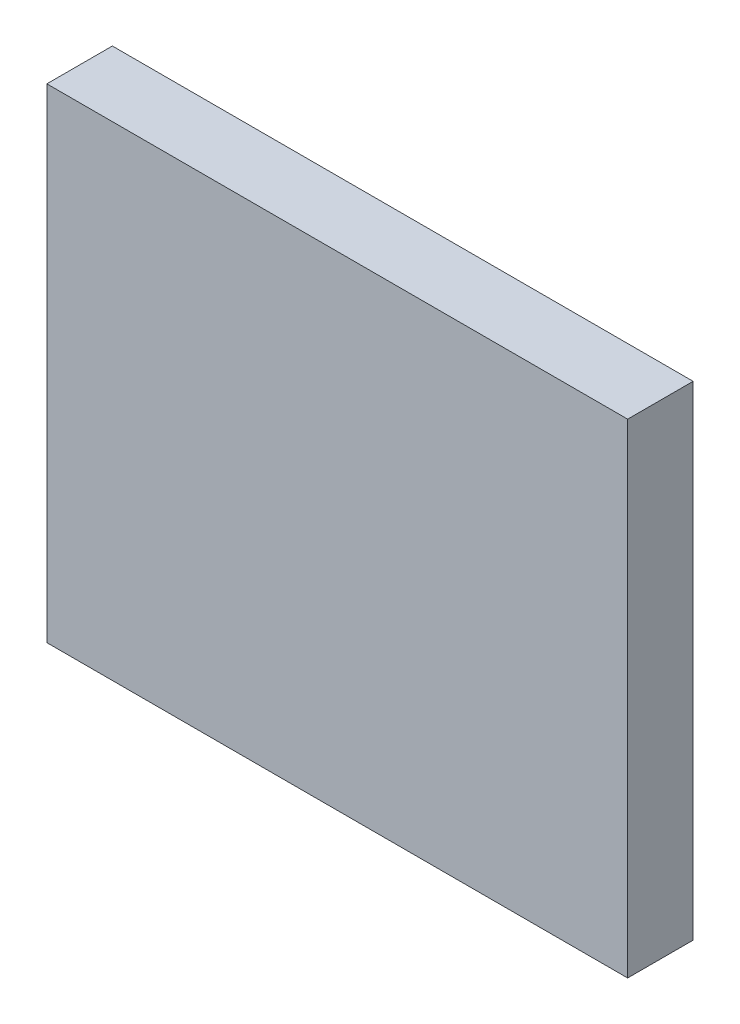
ISO-10303-21;
HEADER;
FILE_DESCRIPTION(('STEP AP214'),'2;1');
FILE_NAME('part.step','',(''),(''),'','','');
FILE_SCHEMA(('AUTOMOTIVE_DESIGN { 1 0 10303 214 1 1 1 1 }'));
ENDSEC;
DATA;
#1=APPLICATION_CONTEXT('core data for automotive mechanical design processes');
#2=APPLICATION_PROTOCOL_DEFINITION('international standard','automotive_design',2000,#1);
#3=PRODUCT_CONTEXT('',#1,'mechanical');
#4=PRODUCT('Part','Part','',(#3));
#5=PRODUCT_RELATED_PRODUCT_CATEGORY('part','',(#4));
#6=PRODUCT_DEFINITION_FORMATION('','',#4);
#7=PRODUCT_DEFINITION_CONTEXT('part definition',#1,'design');
#8=PRODUCT_DEFINITION('design','',#6,#7);
#9=PRODUCT_DEFINITION_SHAPE('','',#8);
#10=(LENGTH_UNIT() NAMED_UNIT(*) SI_UNIT(.MILLI.,.METRE.));
#11=(NAMED_UNIT(*) PLANE_ANGLE_UNIT() SI_UNIT($,.RADIAN.));
#12=(NAMED_UNIT(*) SI_UNIT($,.STERADIAN.) SOLID_ANGLE_UNIT());
#13=UNCERTAINTY_MEASURE_WITH_UNIT(LENGTH_MEASURE(1.E-05),#10,'distance_accuracy_value','');
#14=(GEOMETRIC_REPRESENTATION_CONTEXT(3) GLOBAL_UNCERTAINTY_ASSIGNED_CONTEXT((#13)) GLOBAL_UNIT_ASSIGNED_CONTEXT((#10,
#11,#12)) REPRESENTATION_CONTEXT('',''));
#15=CARTESIAN_POINT('',(0.,0.,0.));
#16=DIRECTION('',(0.,0.,1.));
#17=DIRECTION('',(1.,0.,0.));
#18=AXIS2_PLACEMENT_3D('',#15,#16,#17);
#19=CARTESIAN_POINT('',(90.,75.,20.3));
#20=DIRECTION('',(-1.,0.,0.));
#21=DIRECTION('',(0.,0.,1.));
#22=AXIS2_PLACEMENT_3D('',#19,#20,#21);
#23=PLANE('',#22);
#24=DIRECTION('',(0.,1.,0.));
#25=VECTOR('',#24,1.);
#26=CARTESIAN_POINT('',(90.,75.,0.));
#27=LINE('',#26,#25);
#28=CARTESIAN_POINT('',(90.,-75.,0.));
#29=VERTEX_POINT('',#28);
#30=CARTESIAN_POINT('',(90.,75.,0.));
#31=VERTEX_POINT('',#30);
#32=EDGE_CURVE('E96',#29,#31,#27,.T.);
#33=ORIENTED_EDGE('',*,*,#32,.T.);
#34=DIRECTION('',(0.,0.,-1.));
#35=VECTOR('',#34,1.);
#36=CARTESIAN_POINT('',(90.,75.,20.3));
#37=LINE('',#36,#35);
#38=CARTESIAN_POINT('',(90.,75.,20.3));
#39=VERTEX_POINT('',#38);
#40=EDGE_CURVE('E11',#39,#31,#37,.T.);
#41=ORIENTED_EDGE('',*,*,#40,.F.);
#42=DIRECTION('',(0.,1.,0.));
#43=VECTOR('',#42,1.);
#44=CARTESIAN_POINT('',(90.,75.,20.3));
#45=LINE('',#44,#43);
#46=CARTESIAN_POINT('',(90.,-75.,20.3));
#47=VERTEX_POINT('',#46);
#48=EDGE_CURVE('E84',#47,#39,#45,.T.);
#49=ORIENTED_EDGE('',*,*,#48,.F.);
#50=DIRECTION('',(0.,0.,-1.));
#51=VECTOR('',#50,1.);
#52=CARTESIAN_POINT('',(90.,-75.,20.3));
#53=LINE('',#52,#51);
#54=EDGE_CURVE('E92',#47,#29,#53,.T.);
#55=ORIENTED_EDGE('',*,*,#54,.T.);
#56=EDGE_LOOP('',(#33,#41,#49,#55));
#57=FACE_BOUND('',#56,.T.);
#58=ADVANCED_FACE('F33',(#57),#23,.F.);
#59=CARTESIAN_POINT('',(-90.,75.,20.3));
#60=DIRECTION('',(0.,-1.,0.));
#61=DIRECTION('',(0.,0.,-1.));
#62=AXIS2_PLACEMENT_3D('',#59,#60,#61);
#63=PLANE('',#62);
#64=DIRECTION('',(-1.,0.,0.));
#65=VECTOR('',#64,1.);
#66=CARTESIAN_POINT('',(-90.,75.,0.));
#67=LINE('',#66,#65);
#68=CARTESIAN_POINT('',(-90.,75.,0.));
#69=VERTEX_POINT('',#68);
#70=EDGE_CURVE('E88',#31,#69,#67,.T.);
#71=ORIENTED_EDGE('',*,*,#70,.T.);
#72=DIRECTION('',(0.,0.,-1.));
#73=VECTOR('',#72,1.);
#74=CARTESIAN_POINT('',(-90.,75.,20.3));
#75=LINE('',#74,#73);
#76=CARTESIAN_POINT('',(-90.,75.,20.3));
#77=VERTEX_POINT('',#76);
#78=EDGE_CURVE('E41',#77,#69,#75,.T.);
#79=ORIENTED_EDGE('',*,*,#78,.F.);
#80=DIRECTION('',(-1.,0.,0.));
#81=VECTOR('',#80,1.);
#82=CARTESIAN_POINT('',(-90.,75.,20.3));
#83=LINE('',#82,#81);
#84=EDGE_CURVE('E79',#39,#77,#83,.T.);
#85=ORIENTED_EDGE('',*,*,#84,.F.);
#86=ORIENTED_EDGE('',*,*,#40,.T.);
#87=EDGE_LOOP('',(#71,#79,#85,#86));
#88=FACE_BOUND('',#87,.T.);
#89=ADVANCED_FACE('F87',(#88),#63,.F.);
#90=CARTESIAN_POINT('',(-90.,75.,20.3));
#91=DIRECTION('',(1.,0.,0.));
#92=DIRECTION('',(0.,0.,-1.));
#93=AXIS2_PLACEMENT_3D('',#90,#91,#92);
#94=PLANE('',#93);
#95=DIRECTION('',(0.,-1.,0.));
#96=VECTOR('',#95,1.);
#97=CARTESIAN_POINT('',(-90.,75.,0.));
#98=LINE('',#97,#96);
#99=CARTESIAN_POINT('',(-90.,-75.,0.));
#100=VERTEX_POINT('',#99);
#101=EDGE_CURVE('E66',#69,#100,#98,.T.);
#102=ORIENTED_EDGE('',*,*,#101,.T.);
#103=DIRECTION('',(0.,0.,-1.));
#104=VECTOR('',#103,1.);
#105=CARTESIAN_POINT('',(-90.,-75.,20.3));
#106=LINE('',#105,#104);
#107=CARTESIAN_POINT('',(-90.,-75.,20.3));
#108=VERTEX_POINT('',#107);
#109=EDGE_CURVE('E89',#108,#100,#106,.T.);
#110=ORIENTED_EDGE('',*,*,#109,.F.);
#111=DIRECTION('',(0.,-1.,0.));
#112=VECTOR('',#111,1.);
#113=CARTESIAN_POINT('',(-90.,75.,20.3));
#114=LINE('',#113,#112);
#115=EDGE_CURVE('E82',#77,#108,#114,.T.);
#116=ORIENTED_EDGE('',*,*,#115,.F.);
#117=ORIENTED_EDGE('',*,*,#78,.T.);
#118=EDGE_LOOP('',(#102,#110,#116,#117));
#119=FACE_BOUND('',#118,.T.);
#120=ADVANCED_FACE('F90',(#119),#94,.F.);
#121=CARTESIAN_POINT('',(-90.,-75.,20.3));
#122=DIRECTION('',(0.,1.,0.));
#123=DIRECTION('',(0.,0.,1.));
#124=AXIS2_PLACEMENT_3D('',#121,#122,#123);
#125=PLANE('',#124);
#126=DIRECTION('',(1.,0.,0.));
#127=VECTOR('',#126,1.);
#128=CARTESIAN_POINT('',(-90.,-75.,0.));
#129=LINE('',#128,#127);
#130=EDGE_CURVE('E72',#100,#29,#129,.T.);
#131=ORIENTED_EDGE('',*,*,#130,.T.);
#132=ORIENTED_EDGE('',*,*,#54,.F.);
#133=DIRECTION('',(1.,0.,0.));
#134=VECTOR('',#133,1.);
#135=CARTESIAN_POINT('',(-90.,-75.,20.3));
#136=LINE('',#135,#134);
#137=EDGE_CURVE('E49',#108,#47,#136,.T.);
#138=ORIENTED_EDGE('',*,*,#137,.F.);
#139=ORIENTED_EDGE('',*,*,#109,.T.);
#140=EDGE_LOOP('',(#131,#132,#138,#139));
#141=FACE_BOUND('',#140,.T.);
#142=ADVANCED_FACE('F103',(#141),#125,.F.);
#143=CARTESIAN_POINT('',(0.,0.,20.3));
#144=DIRECTION('',(0.,0.,1.));
#145=DIRECTION('',(1.,0.,0.));
#146=AXIS2_PLACEMENT_3D('',#143,#144,#145);
#147=PLANE('',#146);
#148=ORIENTED_EDGE('',*,*,#48,.T.);
#149=ORIENTED_EDGE('',*,*,#84,.T.);
#150=ORIENTED_EDGE('',*,*,#115,.T.);
#151=ORIENTED_EDGE('',*,*,#137,.T.);
#152=EDGE_LOOP('',(#148,#149,#150,#151));
#153=FACE_BOUND('',#152,.T.);
#154=ADVANCED_FACE('F80',(#153),#147,.T.);
#155=CARTESIAN_POINT('',(0.,0.,0.));
#156=DIRECTION('',(0.,0.,1.));
#157=DIRECTION('',(1.,0.,0.));
#158=AXIS2_PLACEMENT_3D('',#155,#156,#157);
#159=PLANE('',#158);
#160=ORIENTED_EDGE('',*,*,#32,.F.);
#161=ORIENTED_EDGE('',*,*,#130,.F.);
#162=ORIENTED_EDGE('',*,*,#101,.F.);
#163=ORIENTED_EDGE('',*,*,#70,.F.);
#164=EDGE_LOOP('',(#160,#161,#162,#163));
#165=FACE_BOUND('',#164,.T.);
#166=ADVANCED_FACE('F106',(#165),#159,.F.);
#167=CLOSED_SHELL('',(#58,#89,#120,#142,#154,#166));
#168=MANIFOLD_SOLID_BREP('B2',#167);
#169=ADVANCED_BREP_SHAPE_REPRESENTATION('',(#18,#168),#14);
#170=SHAPE_DEFINITION_REPRESENTATION(#9,#169);
ENDSEC;
END-ISO-10303-21;
